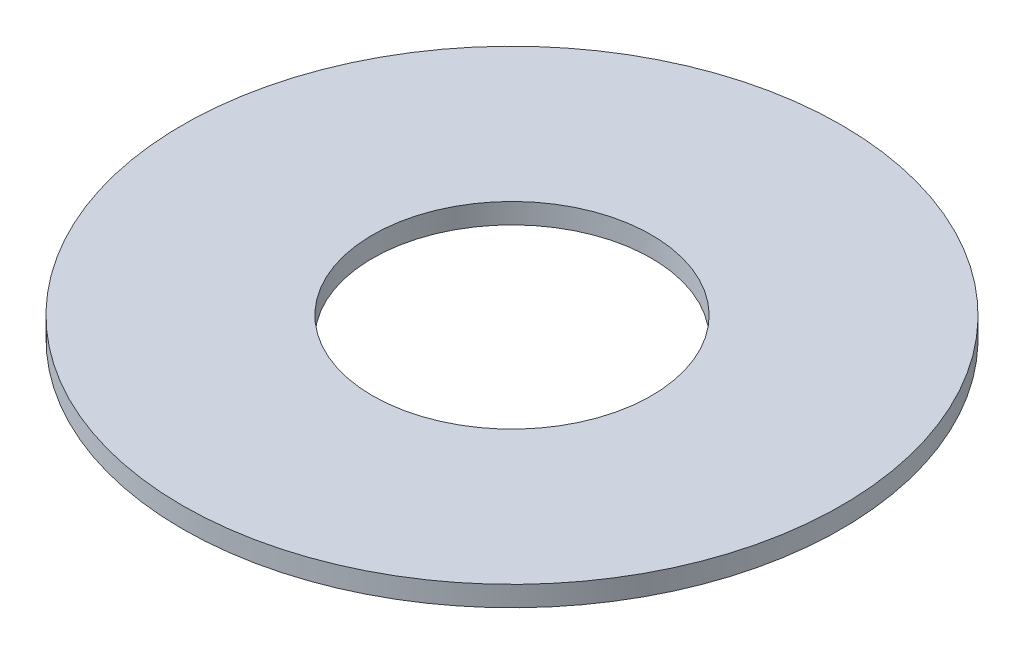
ISO-10303-21;
HEADER;
FILE_DESCRIPTION(('STEP AP214'),'2;1');
FILE_NAME('part.step','',(''),(''),'','','');
FILE_SCHEMA(('AUTOMOTIVE_DESIGN { 1 0 10303 214 1 1 1 1 }'));
ENDSEC;
DATA;
#1=APPLICATION_CONTEXT('core data for automotive mechanical design processes');
#2=APPLICATION_PROTOCOL_DEFINITION('international standard','automotive_design',2000,#1);
#3=PRODUCT_CONTEXT('',#1,'mechanical');
#4=PRODUCT('Part','Part','',(#3));
#5=PRODUCT_RELATED_PRODUCT_CATEGORY('part','',(#4));
#6=PRODUCT_DEFINITION_FORMATION('','',#4);
#7=PRODUCT_DEFINITION_CONTEXT('part definition',#1,'design');
#8=PRODUCT_DEFINITION('design','',#6,#7);
#9=PRODUCT_DEFINITION_SHAPE('','',#8);
#10=(LENGTH_UNIT() NAMED_UNIT(*) SI_UNIT(.MILLI.,.METRE.));
#11=(NAMED_UNIT(*) PLANE_ANGLE_UNIT() SI_UNIT($,.RADIAN.));
#12=(NAMED_UNIT(*) SI_UNIT($,.STERADIAN.) SOLID_ANGLE_UNIT());
#13=UNCERTAINTY_MEASURE_WITH_UNIT(LENGTH_MEASURE(1.E-05),#10,'distance_accuracy_value','');
#14=(GEOMETRIC_REPRESENTATION_CONTEXT(3) GLOBAL_UNCERTAINTY_ASSIGNED_CONTEXT((#13)) GLOBAL_UNIT_ASSIGNED_CONTEXT((#10,
#11,#12)) REPRESENTATION_CONTEXT('',''));
#15=CARTESIAN_POINT('',(0.,0.,0.));
#16=DIRECTION('',(0.,0.,1.));
#17=DIRECTION('',(1.,0.,0.));
#18=AXIS2_PLACEMENT_3D('',#15,#16,#17);
#19=CARTESIAN_POINT('',(0.,4.,0.));
#20=DIRECTION('',(0.,-1.,0.));
#21=DIRECTION('',(0.,0.,-1.));
#22=AXIS2_PLACEMENT_3D('',#19,#20,#21);
#23=CYLINDRICAL_SURFACE('',#22,65.);
#24=CARTESIAN_POINT('',(0.,4.,0.));
#25=DIRECTION('',(0.,1.,0.));
#26=DIRECTION('',(0.,0.,1.));
#27=AXIS2_PLACEMENT_3D('',#24,#25,#26);
#28=CIRCLE('',#27,65.);
#29=CARTESIAN_POINT('',(0.,4.,65.));
#30=VERTEX_POINT('',#29);
#31=EDGE_CURVE('E10',#30,#30,#28,.T.);
#32=ORIENTED_EDGE('',*,*,#31,.F.);
#33=EDGE_LOOP('',(#32));
#34=FACE_BOUND('',#33,.T.);
#35=CARTESIAN_POINT('',(0.,0.,0.));
#36=DIRECTION('',(0.,1.,0.));
#37=DIRECTION('',(0.,0.,1.));
#38=AXIS2_PLACEMENT_3D('',#35,#36,#37);
#39=CIRCLE('',#38,65.);
#40=CARTESIAN_POINT('',(0.,0.,65.));
#41=VERTEX_POINT('',#40);
#42=EDGE_CURVE('E37',#41,#41,#39,.T.);
#43=ORIENTED_EDGE('',*,*,#42,.T.);
#44=EDGE_LOOP('',(#43));
#45=FACE_BOUND('',#44,.T.);
#46=ADVANCED_FACE('F40',(#34,#45),#23,.T.);
#47=CARTESIAN_POINT('',(0.,4.,0.));
#48=DIRECTION('',(0.,1.,0.));
#49=DIRECTION('',(0.,0.,1.));
#50=AXIS2_PLACEMENT_3D('',#47,#48,#49);
#51=PLANE('',#50);
#52=CARTESIAN_POINT('',(0.,4.,0.));
#53=DIRECTION('',(0.,1.,0.));
#54=DIRECTION('',(0.,0.,1.));
#55=AXIS2_PLACEMENT_3D('',#52,#53,#54);
#56=CIRCLE('',#55,27.5);
#57=CARTESIAN_POINT('',(0.,4.,27.5));
#58=VERTEX_POINT('',#57);
#59=EDGE_CURVE('E50',#58,#58,#56,.T.);
#60=ORIENTED_EDGE('',*,*,#59,.F.);
#61=EDGE_LOOP('',(#60));
#62=FACE_BOUND('',#61,.T.);
#63=ORIENTED_EDGE('',*,*,#31,.T.);
#64=EDGE_LOOP('',(#63));
#65=FACE_BOUND('',#64,.T.);
#66=ADVANCED_FACE('F59',(#62,#65),#51,.T.);
#67=CARTESIAN_POINT('',(0.,0.,0.));
#68=DIRECTION('',(0.,1.,0.));
#69=DIRECTION('',(0.,0.,1.));
#70=AXIS2_PLACEMENT_3D('',#67,#68,#69);
#71=PLANE('',#70);
#72=CARTESIAN_POINT('',(0.,0.,0.));
#73=DIRECTION('',(0.,1.,0.));
#74=DIRECTION('',(0.,0.,1.));
#75=AXIS2_PLACEMENT_3D('',#72,#73,#74);
#76=CIRCLE('',#75,27.5);
#77=CARTESIAN_POINT('',(0.,0.,27.5));
#78=VERTEX_POINT('',#77);
#79=EDGE_CURVE('E47',#78,#78,#76,.T.);
#80=ORIENTED_EDGE('',*,*,#79,.T.);
#81=EDGE_LOOP('',(#80));
#82=FACE_BOUND('',#81,.T.);
#83=ORIENTED_EDGE('',*,*,#42,.F.);
#84=EDGE_LOOP('',(#83));
#85=FACE_BOUND('',#84,.T.);
#86=ADVANCED_FACE('F58',(#82,#85),#71,.F.);
#87=CARTESIAN_POINT('',(0.,4.,0.));
#88=DIRECTION('',(0.,-1.,0.));
#89=DIRECTION('',(0.,0.,-1.));
#90=AXIS2_PLACEMENT_3D('',#87,#88,#89);
#91=CYLINDRICAL_SURFACE('',#90,27.5);
#92=ORIENTED_EDGE('',*,*,#59,.T.);
#93=EDGE_LOOP('',(#92));
#94=FACE_BOUND('',#93,.T.);
#95=ORIENTED_EDGE('',*,*,#79,.F.);
#96=EDGE_LOOP('',(#95));
#97=FACE_BOUND('',#96,.T.);
#98=ADVANCED_FACE('F54',(#94,#97),#91,.F.);
#99=CLOSED_SHELL('',(#46,#66,#86,#98));
#100=MANIFOLD_SOLID_BREP('B2',#99);
#101=ADVANCED_BREP_SHAPE_REPRESENTATION('',(#18,#100),#14);
#102=SHAPE_DEFINITION_REPRESENTATION(#9,#101);
ENDSEC;
END-ISO-10303-21;
